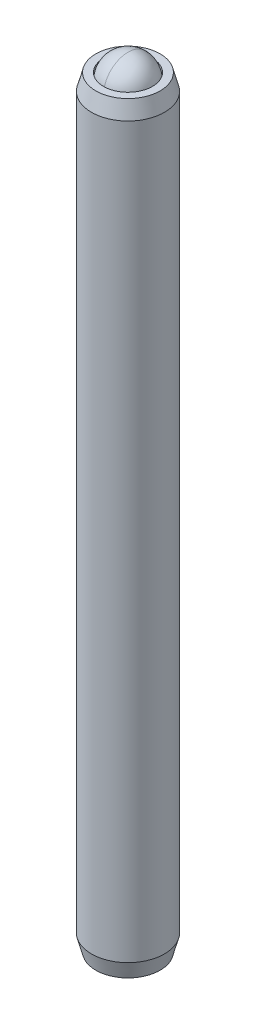
ISO-10303-21;
HEADER;
FILE_DESCRIPTION(('STEP AP214'),'2;1');
FILE_NAME('part.step','',(''),(''),'','','');
FILE_SCHEMA(('AUTOMOTIVE_DESIGN { 1 0 10303 214 1 1 1 1 }'));
ENDSEC;
DATA;
#1=APPLICATION_CONTEXT('core data for automotive mechanical design processes');
#2=APPLICATION_PROTOCOL_DEFINITION('international standard','automotive_design',2000,#1);
#3=PRODUCT_CONTEXT('',#1,'mechanical');
#4=PRODUCT('Part','Part','',(#3));
#5=PRODUCT_RELATED_PRODUCT_CATEGORY('part','',(#4));
#6=PRODUCT_DEFINITION_FORMATION('','',#4);
#7=PRODUCT_DEFINITION_CONTEXT('part definition',#1,'design');
#8=PRODUCT_DEFINITION('design','',#6,#7);
#9=PRODUCT_DEFINITION_SHAPE('','',#8);
#10=(LENGTH_UNIT() NAMED_UNIT(*) SI_UNIT(.MILLI.,.METRE.));
#11=(NAMED_UNIT(*) PLANE_ANGLE_UNIT() SI_UNIT($,.RADIAN.));
#12=(NAMED_UNIT(*) SI_UNIT($,.STERADIAN.) SOLID_ANGLE_UNIT());
#13=UNCERTAINTY_MEASURE_WITH_UNIT(LENGTH_MEASURE(1.E-05),#10,'distance_accuracy_value','');
#14=(GEOMETRIC_REPRESENTATION_CONTEXT(3) GLOBAL_UNCERTAINTY_ASSIGNED_CONTEXT((#13)) GLOBAL_UNIT_ASSIGNED_CONTEXT((#10,
#11,#12)) REPRESENTATION_CONTEXT('',''));
#15=CARTESIAN_POINT('',(0.,0.,0.));
#16=DIRECTION('',(0.,0.,1.));
#17=DIRECTION('',(1.,0.,0.));
#18=AXIS2_PLACEMENT_3D('',#15,#16,#17);
#19=CARTESIAN_POINT('',(19.4363284208888,41.2034664930245,44.0016091784488));
#20=DIRECTION('',(0.,0.,-1.));
#21=DIRECTION('',(1.,0.,0.));
#22=AXIS2_PLACEMENT_3D('',#19,#20,#21);
#23=SPHERICAL_SURFACE('',#22,1.5875);
#24=CARTESIAN_POINT('',(19.4363284208888,41.2034664930245,44.0016091784488));
#25=DIRECTION('',(0.,-1.,0.));
#26=DIRECTION('',(1.,0.,0.));
#27=AXIS2_PLACEMENT_3D('',#24,#25,#26);
#28=CIRCLE('',#27,1.5875);
#29=CARTESIAN_POINT('',(19.4363284208888,41.2034664930245,45.5891091784488));
#30=VERTEX_POINT('',#29);
#31=CARTESIAN_POINT('',(19.4363284208888,41.2034664930245,42.4141091784488));
#32=VERTEX_POINT('',#31);
#33=EDGE_CURVE('P0_E37',#30,#32,#28,.T.);
#34=ORIENTED_EDGE('',*,*,#33,.F.);
#35=CARTESIAN_POINT('',(19.4363284208888,41.2034664930245,44.0016091784488));
#36=DIRECTION('',(-1.,0.,0.));
#37=DIRECTION('',(0.,-1.,0.));
#38=AXIS2_PLACEMENT_3D('',#35,#36,#37);
#39=CIRCLE('',#38,1.5875);
#40=EDGE_CURVE('P0_E11',#30,#32,#39,.T.);
#41=ORIENTED_EDGE('',*,*,#40,.T.);
#42=EDGE_LOOP('',(#34,#41));
#43=FACE_BOUND('',#42,.T.);
#44=ADVANCED_FACE('P0_F16',(#43),#23,.T.);
#45=ORIENTED_EDGE('',*,*,#33,.T.);
#46=CARTESIAN_POINT('',(19.4363284208888,41.2034664930245,44.0016091784488));
#47=DIRECTION('',(-1.,0.,0.));
#48=DIRECTION('',(0.,-1.,0.));
#49=AXIS2_PLACEMENT_3D('',#46,#47,#48);
#50=CIRCLE('',#49,1.5875);
#51=EDGE_CURVE('P0_E23',#32,#30,#50,.T.);
#52=ORIENTED_EDGE('',*,*,#51,.T.);
#53=EDGE_LOOP('',(#45,#52));
#54=FACE_BOUND('',#53,.T.);
#55=ADVANCED_FACE('P0_F36',(#54),#23,.T.);
#56=ORIENTED_EDGE('',*,*,#51,.F.);
#57=EDGE_CURVE('P0_E33',#32,#30,#28,.T.);
#58=ORIENTED_EDGE('',*,*,#57,.T.);
#59=EDGE_LOOP('',(#56,#58));
#60=FACE_BOUND('',#59,.T.);
#61=ADVANCED_FACE('P0_F39',(#60),#23,.T.);
#62=ORIENTED_EDGE('',*,*,#40,.F.);
#63=ORIENTED_EDGE('',*,*,#57,.F.);
#64=EDGE_LOOP('',(#62,#63));
#65=FACE_BOUND('',#64,.T.);
#66=ADVANCED_FACE('P0_F18',(#65),#23,.T.);
#67=CLOSED_SHELL('',(#44,#55,#61,#66));
#68=MANIFOLD_SOLID_BREP('P0_B1',#67);
#69=CARTESIAN_POINT('',(19.4363284208888,-6.85968350697545,44.0016091784488));
#70=DIRECTION('',(0.,-1.,0.));
#71=DIRECTION('',(1.,0.,0.));
#72=AXIS2_PLACEMENT_3D('',#69,#70,#71);
#73=CONICAL_SURFACE('',#72,0.,0.785398163397452);
#74=CARTESIAN_POINT('',(19.4363284208888,-8.00268350697544,44.0016091784488));
#75=DIRECTION('',(0.,1.,0.));
#76=DIRECTION('',(-1.,0.,0.));
#77=AXIS2_PLACEMENT_3D('',#74,#75,#76);
#78=CIRCLE('',#77,1.143);
#79=CARTESIAN_POINT('',(20.5793189322147,-8.00268350697544,43.9969518166343));
#80=VERTEX_POINT('',#79);
#81=CARTESIAN_POINT('',(20.0118570701977,-8.00268350697544,43.0140790402633));
#82=VERTEX_POINT('',#81);
#83=EDGE_CURVE('P1_E241',#80,#82,#78,.T.);
#84=ORIENTED_EDGE('',*,*,#83,.F.);
#85=CARTESIAN_POINT('',(20.5795284208888,-8.00289157328465,43.9973146616615));
#86=CARTESIAN_POINT('',(20.5795257144675,-8.00288888449195,43.9973099740023));
#87=CARTESIAN_POINT('',(20.5795230080402,-8.00288619572221,43.9973052863328));
#88=CARTESIAN_POINT('',(20.5600306777428,-7.98352124668565,43.9635435799138));
#89=CARTESIAN_POINT('',(20.5402345814781,-7.96534984259609,43.9292557353815));
#90=CARTESIAN_POINT('',(20.4999732437292,-7.93214996165345,43.8595210528121));
#91=CARTESIAN_POINT('',(20.4795076352042,-7.91712324333893,43.8240735790419));
#92=CARTESIAN_POINT('',(20.4379766526946,-7.89117950454162,43.752139807249));
#93=CARTESIAN_POINT('',(20.4169129129655,-7.8802522639107,43.71565633984));
#94=CARTESIAN_POINT('',(20.3742945535118,-7.8634157329125,43.6418391759304));
#95=CARTESIAN_POINT('',(20.3527404730571,-7.85750117992885,43.6045064134727));
#96=CARTESIAN_POINT('',(20.3155662540117,-7.85219081735782,43.5401187773544));
#97=CARTESIAN_POINT('',(20.2999934074969,-7.85142371548408,43.5131458159723));
#98=CARTESIAN_POINT('',(20.2688792224096,-7.85281959215813,43.4592544665649));
#99=CARTESIAN_POINT('',(20.2533378913283,-7.85498320049636,43.4323360915149));
#100=CARTESIAN_POINT('',(20.2069289668936,-7.86572571714785,43.3519534764695));
#101=CARTESIAN_POINT('',(20.1762943247543,-7.87855868149786,43.2988927198124));
#102=CARTESIAN_POINT('',(20.1230854280154,-7.90918374679279,43.2067322072459));
#103=CARTESIAN_POINT('',(20.1002391952613,-7.92522787163296,43.1671613713544));
#104=CARTESIAN_POINT('',(20.0553560107262,-7.96131856801589,43.089421415334));
#105=CARTESIAN_POINT('',(20.0333191554072,-7.98136561480879,43.0512524622825));
#106=CARTESIAN_POINT('',(19.9902331277341,-8.0241621361576,42.9766252732564));
#107=CARTESIAN_POINT('',(19.969175697669,-8.04687908314869,42.9401527345068));
#108=CARTESIAN_POINT('',(19.9277513096075,-8.09440258828207,42.8684035897118));
#109=CARTESIAN_POINT('',(19.9073822280737,-8.11920169963308,42.8331233055918));
#110=CARTESIAN_POINT('',(19.8872656451284,-8.14473005128733,42.7982803618558));
#111=B_SPLINE_CURVE_WITH_KNOTS('',3,(#85,#86,#87,#88,#89,#90,#91,#92,#93,#94,#95,#96,#97,#98,
#99,#100,#101,#102,#103,#104,#105,#106,#107,#108,#109,#110),.UNSPECIFIED.,.F.,.F.,(4,2,2,2,2,2,
2,2,2,2,2,2,4),(0.,1.81316377766521E-05,0.130588066149644,0.261230822659524,0.391545682806067,
0.521723560618484,0.61505376898685,0.708404036588612,0.895210399439819,1.04029045701993,
1.18538774959988,1.32887166801466,1.47186265945496),.UNSPECIFIED.);
#112=EDGE_CURVE('P1_E11',#80,#82,#111,.T.);
#113=ORIENTED_EDGE('',*,*,#112,.T.);
#114=EDGE_LOOP('',(#84,#113));
#115=FACE_BOUND('',#114,.T.);
#116=ADVANCED_FACE('P1_F16',(#115),#73,.F.);
#117=CARTESIAN_POINT('',(20.0037902829058,-8.00268350697544,43.0094216784488));
#118=VERTEX_POINT('',#117);
#119=CARTESIAN_POINT('',(18.8688665588719,-8.00268350697544,43.0094216784488));
#120=VERTEX_POINT('',#119);
#121=EDGE_CURVE('P1_E245',#118,#120,#78,.T.);
#122=ORIENTED_EDGE('',*,*,#121,.F.);
#123=CARTESIAN_POINT('',(18.2956976132517,-8.37146215297065,43.0094216784488));
#124=CARTESIAN_POINT('',(18.3234795799085,-8.3505039669229,43.0094216784488));
#125=CARTESIAN_POINT('',(18.3514165472458,-8.32975182567534,43.0094216784488));
#126=CARTESIAN_POINT('',(18.4076632979894,-8.28874468856195,43.0094216784488));
#127=CARTESIAN_POINT('',(18.4359731727808,-8.26848981817666,43.0094216784488));
#128=CARTESIAN_POINT('',(18.5219708570497,-8.20830969756909,43.0094216784488));
#129=CARTESIAN_POINT('',(18.5803043030779,-8.16929175546804,43.0094216784488));
#130=CARTESIAN_POINT('',(18.7026153822138,-8.09271173297564,43.0094216784488));
#131=CARTESIAN_POINT('',(18.7667253455534,-8.05535859651509,43.0094216784488));
#132=CARTESIAN_POINT('',(18.8981450647406,-7.98704353196994,43.0094216784488));
#133=CARTESIAN_POINT('',(18.9654430549452,-7.95606006064756,43.0094216784488));
#134=CARTESIAN_POINT('',(19.0664756524543,-7.9181552165379,43.0094216784488));
#135=CARTESIAN_POINT('',(19.0987183686434,-7.90727317477064,43.0094216784488));
#136=CARTESIAN_POINT('',(19.1639805892829,-7.8880978757605,43.0094216784488));
#137=CARTESIAN_POINT('',(19.1970001472332,-7.87980479737932,43.0094216784488));
#138=CARTESIAN_POINT('',(19.2630626115991,-7.86637686449944,43.0094216784488));
#139=CARTESIAN_POINT('',(19.2960942744037,-7.8611875549149,43.0094216784488));
#140=CARTESIAN_POINT('',(19.3625196064881,-7.8540648590462,43.0094216784488));
#141=CARTESIAN_POINT('',(19.395913330646,-7.85213197348667,43.0094216784488));
#142=CARTESIAN_POINT('',(19.4615227040728,-7.85166805763632,43.0094216784488));
#143=CARTESIAN_POINT('',(19.4937375479298,-7.85301723119191,43.0094216784488));
#144=CARTESIAN_POINT('',(19.557879675408,-7.85877819024429,43.0094216784488));
#145=CARTESIAN_POINT('',(19.58980702331,-7.86318927299811,43.0094216784488));
#146=CARTESIAN_POINT('',(19.6536995168981,-7.87490835617852,43.0094216784488));
#147=CARTESIAN_POINT('',(19.6856554098724,-7.88226604695359,43.0094216784488));
#148=CARTESIAN_POINT('',(19.7488692017713,-7.89948781984245,43.0094216784488));
#149=CARTESIAN_POINT('',(19.7801271594913,-7.90935168995766,43.0094216784488));
#150=CARTESIAN_POINT('',(19.8786239753269,-7.94414206598179,43.0094216784488));
#151=CARTESIAN_POINT('',(19.9444586897626,-7.9730342916115,43.0094216784488));
#152=CARTESIAN_POINT('',(20.0730345784676,-8.03727019133514,43.0094216784488));
#153=CARTESIAN_POINT('',(20.1357635656807,-8.07263706068711,43.0094216784488));
#154=CARTESIAN_POINT('',(20.2556464363632,-8.1455993766631,43.0094216784488));
#155=CARTESIAN_POINT('',(20.3129224486739,-8.18299663783958,43.0094216784488));
#156=CARTESIAN_POINT('',(20.3973071662296,-8.2408078059348,43.0094216784488));
#157=CARTESIAN_POINT('',(20.425071165797,-8.2602818170261,43.0094216784488));
#158=CARTESIAN_POINT('',(20.4802198408537,-8.29974458995869,43.0094216784488));
#159=CARTESIAN_POINT('',(20.5076046179868,-8.31973320959427,43.0094216784488));
#160=CARTESIAN_POINT('',(20.5348315050751,-8.33993519541325,43.0094216784488));
#161=B_SPLINE_CURVE_WITH_KNOTS('',3,(#123,#124,#125,#126,#127,#128,#129,#130,#131,#132,#133,
#134,#135,#136,#137,#138,#139,#140,#141,#142,#143,#144,#145,#146,#147,#148,#149,#150,#151,#152,
#153,#154,#155,#156,#157,#158,#159,#160),.UNSPECIFIED.,.F.,.F.,(4,2,2,2,2,2,2,2,2,2,2,2,2,2,2,2,
2,2,4),(0.,0.104399205750145,0.208824490153929,0.419269037607603,0.641680044169895,
0.863325974887587,0.965328311414922,1.06733769333986,1.16750041530699,1.26767853740811,
1.3642553320756,1.46080996859686,1.55906646638462,1.6573146553866,1.87236816316004,
2.08820773237252,2.29331760239732,2.39505206150514,2.49675870307947),.UNSPECIFIED.);
#162=EDGE_CURVE('P1_E30',#118,#120,#161,.F.);
#163=ORIENTED_EDGE('',*,*,#162,.T.);
#164=EDGE_LOOP('',(#122,#163));
#165=FACE_BOUND('',#164,.T.);
#166=ADVANCED_FACE('P1_F232',(#165),#73,.F.);
#167=CARTESIAN_POINT('',(18.8607997715799,-8.00268350697544,43.0140790402633));
#168=VERTEX_POINT('',#167);
#169=CARTESIAN_POINT('',(18.293337909563,-8.00268350697544,43.9969518166343));
#170=VERTEX_POINT('',#169);
#171=EDGE_CURVE('P1_E162',#168,#170,#78,.T.);
#172=ORIENTED_EDGE('',*,*,#171,.F.);
#173=CARTESIAN_POINT('',(18.9853911966492,-8.14473005128732,42.7982803618558));
#174=CARTESIAN_POINT('',(18.9654134434931,-8.11937636137871,42.8328828453433));
#175=CARTESIAN_POINT('',(18.9451843015619,-8.09474115364876,42.8679207469617));
#176=CARTESIAN_POINT('',(18.9037667580097,-8.04718761012867,42.9396580367188));
#177=CARTESIAN_POINT('',(18.8825678396076,-8.02430611311324,42.9763756404567));
#178=CARTESIAN_POINT('',(18.8414277221805,-7.98344086308087,43.0476324140698));
#179=CARTESIAN_POINT('',(18.8215513649233,-7.9651998992218,43.0820592747088));
#180=CARTESIAN_POINT('',(18.7811279003515,-7.93189582831574,43.152074769165));
#181=CARTESIAN_POINT('',(18.7605806659785,-7.91683332732174,43.1876636230541));
#182=CARTESIAN_POINT('',(18.719043948857,-7.89095675040179,43.2596073274882));
#183=CARTESIAN_POINT('',(18.6980611170448,-7.88010089726359,43.2959506582735));
#184=CARTESIAN_POINT('',(18.6556073575053,-7.86336944280465,43.3694827267684));
#185=CARTESIAN_POINT('',(18.6341369163087,-7.85748908339188,43.4066706217818));
#186=CARTESIAN_POINT('',(18.5970580612995,-7.85219241325834,43.4708930825442));
#187=CARTESIAN_POINT('',(18.5814962532154,-7.85142478466415,43.4978469248033));
#188=CARTESIAN_POINT('',(18.5504040008211,-7.85281556334071,43.5517002856722));
#189=CARTESIAN_POINT('',(18.534873563838,-7.85497458932804,43.5785997915906));
#190=CARTESIAN_POINT('',(18.4884533156515,-7.86570756358604,43.6590020199496));
#191=CARTESIAN_POINT('',(18.4577970613585,-7.87854568745243,43.7121002099549));
#192=CARTESIAN_POINT('',(18.404579967435,-7.90917616466416,43.8042749204615));
#193=CARTESIAN_POINT('',(18.3817461733049,-7.92521041550376,43.8438242120244));
#194=CARTESIAN_POINT('',(18.3480907334006,-7.95226751774215,43.9021171438896));
#195=CARTESIAN_POINT('',(18.3369627717022,-7.96179636268222,43.921391338936));
#196=CARTESIAN_POINT('',(18.3149047512131,-7.98172113786374,43.9595969511375));
#197=CARTESIAN_POINT('',(18.303974667269,-7.99211695694335,43.9785284118597));
#198=CARTESIAN_POINT('',(18.2698963109932,-8.02597025323001,44.0375538563679));
#199=CARTESIAN_POINT('',(18.2470789026698,-8.0507616336181,44.0770747668809));
#200=CARTESIAN_POINT('',(18.2021515675663,-8.10280357376023,44.1548911939288));
#201=CARTESIAN_POINT('',(18.1800420682185,-8.13005558266673,44.1931859701291));
#202=CARTESIAN_POINT('',(18.136341539269,-8.18643901453588,44.2688775065874));
#203=CARTESIAN_POINT('',(18.1147522320756,-8.21557574597252,44.3062712835465));
#204=CARTESIAN_POINT('',(18.0720452176147,-8.2752047403616,44.3802420024324));
#205=CARTESIAN_POINT('',(18.0509275843405,-8.30569721378192,44.4168188161989));
#206=CARTESIAN_POINT('',(17.9894173425083,-8.39681603650873,44.5233576802382));
#207=CARTESIAN_POINT('',(17.9495468767431,-8.45885026609265,44.5924153526649));
#208=CARTESIAN_POINT('',(17.8906097620809,-8.55343956980017,44.6944974297114));
#209=CARTESIAN_POINT('',(17.8711795217175,-8.58510502947861,44.7281515932241));
#210=CARTESIAN_POINT('',(17.8325232709737,-8.64891553809655,44.7951061835424));
#211=CARTESIAN_POINT('',(17.8132972206542,-8.68106049017623,44.8284066795247));
#212=CARTESIAN_POINT('',(17.7941526793724,-8.71340055577849,44.8615659977124));
#213=B_SPLINE_CURVE_WITH_KNOTS('',3,(#173,#174,#175,#176,#177,#178,#179,#180,#181,#182,#183,
#184,#185,#186,#187,#188,#189,#190,#191,#192,#193,#194,#195,#196,#197,#198,#199,#200,#201,#202,
#203,#204,#205,#206,#207,#208,#209,#210,#211,#212),.UNSPECIFIED.,.F.,.F.,(4,2,2,2,2,2,2,2,2,2,2,
2,2,2,2,2,2,2,2,4),(0.,0.142015492124806,0.28647478580433,0.417582578490755,0.548715347595062,
0.678510217108288,0.808180822332932,0.901445197909871,0.994729293345598,1.18166731759613,
1.32665810540213,1.39927013153267,1.47187286175304,1.62755511883546,1.78332966839059,
1.93956387642132,2.09582242380834,2.39881912123291,2.54920251539603,2.69955593206455),.UNSPECIFIED.);
#214=EDGE_CURVE('P1_E258',#168,#170,#213,.T.);
#215=ORIENTED_EDGE('',*,*,#214,.T.);
#216=EDGE_LOOP('',(#172,#215));
#217=FACE_BOUND('',#216,.T.);
#218=ADVANCED_FACE('P1_F237',(#217),#73,.F.);
#219=CARTESIAN_POINT('',(18.293337909563,-8.00268350697544,44.0062665402633));
#220=VERTEX_POINT('',#219);
#221=CARTESIAN_POINT('',(18.8607997715799,-8.00268350697544,44.9891393166343));
#222=VERTEX_POINT('',#221);
#223=EDGE_CURVE('P1_E173',#220,#222,#78,.T.);
#224=ORIENTED_EDGE('',*,*,#223,.F.);
#225=CARTESIAN_POINT('',(18.2931284208888,-8.00289157328465,44.0059036952361));
#226=CARTESIAN_POINT('',(18.2931311273102,-8.00288888449195,44.0059083828953));
#227=CARTESIAN_POINT('',(18.2931338337374,-8.00288619572221,44.0059130705648));
#228=CARTESIAN_POINT('',(18.3126261640282,-7.98352124668405,44.0396747769866));
#229=CARTESIAN_POINT('',(18.3324222602976,-7.96534984259576,44.0739626215167));
#230=CARTESIAN_POINT('',(18.37268359805,-7.93214996165405,44.1436973040843));
#231=CARTESIAN_POINT('',(18.3931492065737,-7.91712324333921,44.1791447778551));
#232=CARTESIAN_POINT('',(18.4346801890824,-7.89117950454161,44.2510785496485));
#233=CARTESIAN_POINT('',(18.4557439288119,-7.88025226391073,44.2875620170575));
#234=CARTESIAN_POINT('',(18.4983622882659,-7.86341573291254,44.361379180967));
#235=CARTESIAN_POINT('',(18.5199163687205,-7.85750117992886,44.3987119434249));
#236=CARTESIAN_POINT('',(18.557090587766,-7.85219081735781,44.4630995795433));
#237=CARTESIAN_POINT('',(18.5726634342808,-7.85142371548408,44.4900725409254));
#238=CARTESIAN_POINT('',(18.6037776193682,-7.85281959215814,44.5439638903328));
#239=CARTESIAN_POINT('',(18.6193189504495,-7.85498320049638,44.5708822653829));
#240=CARTESIAN_POINT('',(18.6657278748841,-7.86572571714789,44.6512648804283));
#241=CARTESIAN_POINT('',(18.6963625170234,-7.87855868149789,44.7043256370853));
#242=CARTESIAN_POINT('',(18.7495714137623,-7.90918374679278,44.7964861496517));
#243=CARTESIAN_POINT('',(18.7724176465163,-7.92522787163294,44.8360569855432));
#244=CARTESIAN_POINT('',(18.8173008310515,-7.96131856801587,44.9137969415636));
#245=CARTESIAN_POINT('',(18.8393376863704,-7.98136561480878,44.9519658946151));
#246=CARTESIAN_POINT('',(18.8824237140435,-8.02416213615762,45.0265930836412));
#247=CARTESIAN_POINT('',(18.9034811441087,-8.04687908314873,45.0630656223908));
#248=CARTESIAN_POINT('',(18.9449055321702,-8.0944025882821,45.1348147671858));
#249=CARTESIAN_POINT('',(18.9652746137039,-8.11920169963309,45.1700950513058));
#250=CARTESIAN_POINT('',(18.9853911966492,-8.14473005128733,45.2049379950418));
#251=B_SPLINE_CURVE_WITH_KNOTS('',3,(#225,#226,#227,#228,#229,#230,#231,#232,#233,#234,#235,
#236,#237,#238,#239,#240,#241,#242,#243,#244,#245,#246,#247,#248,#249,#250),.UNSPECIFIED.,.F.,
.F.,(4,2,2,2,2,2,2,2,2,2,2,2,4),(0.,1.81316377750985E-05,0.130588066149251,0.261230822658986,
0.391545682805917,0.521723560618475,0.615053768986976,0.708404036588908,0.895210399439817,
1.04029045701984,1.18538774959988,1.32887166801475,1.47186265945496),.UNSPECIFIED.);
#252=EDGE_CURVE('P1_E260',#220,#222,#251,.T.);
#253=ORIENTED_EDGE('',*,*,#252,.T.);
#254=EDGE_LOOP('',(#224,#253));
#255=FACE_BOUND('',#254,.T.);
#256=ADVANCED_FACE('P1_F297',(#255),#73,.F.);
#257=CARTESIAN_POINT('',(18.8688665588719,-8.00268350697544,44.9937966784488));
#258=VERTEX_POINT('',#257);
#259=CARTESIAN_POINT('',(20.0037902829058,-8.00268350697544,44.9937966784488));
#260=VERTEX_POINT('',#259);
#261=EDGE_CURVE('P1_E177',#258,#260,#78,.T.);
#262=ORIENTED_EDGE('',*,*,#261,.F.);
#263=CARTESIAN_POINT('',(18.2956976132517,-8.37146215297065,44.9937966784488));
#264=CARTESIAN_POINT('',(18.3234795799085,-8.3505039669229,44.9937966784488));
#265=CARTESIAN_POINT('',(18.3514165472458,-8.32975182567534,44.9937966784488));
#266=CARTESIAN_POINT('',(18.4076632979894,-8.28874468856195,44.9937966784488));
#267=CARTESIAN_POINT('',(18.4359731727808,-8.26848981817666,44.9937966784488));
#268=CARTESIAN_POINT('',(18.5219708570497,-8.20830969756909,44.9937966784488));
#269=CARTESIAN_POINT('',(18.5803043030779,-8.16929175546804,44.9937966784488));
#270=CARTESIAN_POINT('',(18.7026153822138,-8.09271173297564,44.9937966784488));
#271=CARTESIAN_POINT('',(18.7667253455534,-8.05535859651509,44.9937966784488));
#272=CARTESIAN_POINT('',(18.8981450647406,-7.98704353196994,44.9937966784488));
#273=CARTESIAN_POINT('',(18.9654430549452,-7.95606006064756,44.9937966784488));
#274=CARTESIAN_POINT('',(19.0664756524543,-7.9181552165379,44.9937966784488));
#275=CARTESIAN_POINT('',(19.0987183686434,-7.90727317477064,44.9937966784488));
#276=CARTESIAN_POINT('',(19.1639805892829,-7.8880978757605,44.9937966784488));
#277=CARTESIAN_POINT('',(19.1970001472332,-7.87980479737932,44.9937966784488));
#278=CARTESIAN_POINT('',(19.2630626115991,-7.86637686449944,44.9937966784488));
#279=CARTESIAN_POINT('',(19.2960942744037,-7.8611875549149,44.9937966784488));
#280=CARTESIAN_POINT('',(19.3625196064881,-7.8540648590462,44.9937966784488));
#281=CARTESIAN_POINT('',(19.395913330646,-7.85213197348667,44.9937966784488));
#282=CARTESIAN_POINT('',(19.4615227040728,-7.85166805763632,44.9937966784488));
#283=CARTESIAN_POINT('',(19.4937375479298,-7.85301723119191,44.9937966784488));
#284=CARTESIAN_POINT('',(19.557879675408,-7.85877819024429,44.9937966784488));
#285=CARTESIAN_POINT('',(19.58980702331,-7.86318927299811,44.9937966784488));
#286=CARTESIAN_POINT('',(19.6536995168981,-7.87490835617852,44.9937966784488));
#287=CARTESIAN_POINT('',(19.6856554098724,-7.88226604695359,44.9937966784488));
#288=CARTESIAN_POINT('',(19.7488692017713,-7.89948781984245,44.9937966784488));
#289=CARTESIAN_POINT('',(19.7801271594913,-7.90935168995766,44.9937966784488));
#290=CARTESIAN_POINT('',(19.8786239753269,-7.94414206598179,44.9937966784488));
#291=CARTESIAN_POINT('',(19.9444586897626,-7.9730342916115,44.9937966784488));
#292=CARTESIAN_POINT('',(20.0730345784676,-8.03727019133514,44.9937966784488));
#293=CARTESIAN_POINT('',(20.1357635656807,-8.07263706068711,44.9937966784488));
#294=CARTESIAN_POINT('',(20.2556464363632,-8.1455993766631,44.9937966784488));
#295=CARTESIAN_POINT('',(20.3129224486739,-8.18299663783958,44.9937966784488));
#296=CARTESIAN_POINT('',(20.3973071662296,-8.2408078059348,44.9937966784488));
#297=CARTESIAN_POINT('',(20.425071165797,-8.26028181702611,44.9937966784488));
#298=CARTESIAN_POINT('',(20.4802198408537,-8.29974458995869,44.9937966784488));
#299=CARTESIAN_POINT('',(20.5076046179868,-8.31973320959427,44.9937966784488));
#300=CARTESIAN_POINT('',(20.5348315050751,-8.33993519541325,44.9937966784488));
#301=B_SPLINE_CURVE_WITH_KNOTS('',3,(#263,#264,#265,#266,#267,#268,#269,#270,#271,#272,#273,
#274,#275,#276,#277,#278,#279,#280,#281,#282,#283,#284,#285,#286,#287,#288,#289,#290,#291,#292,
#293,#294,#295,#296,#297,#298,#299,#300),.UNSPECIFIED.,.F.,.F.,(4,2,2,2,2,2,2,2,2,2,2,2,2,2,2,2,
2,2,4),(0.,0.104399205750145,0.208824490153929,0.419269037607603,0.641680044169895,
0.863325974887587,0.965328311414922,1.06733769333986,1.16750041530699,1.26767853740811,
1.3642553320756,1.46080996859686,1.55906646638462,1.6573146553866,1.87236816316004,
2.08820773237252,2.29331760239732,2.39505206150514,2.49675870307947),.UNSPECIFIED.);
#302=EDGE_CURVE('P1_E202',#258,#260,#301,.T.);
#303=ORIENTED_EDGE('',*,*,#302,.T.);
#304=EDGE_LOOP('',(#262,#303));
#305=FACE_BOUND('',#304,.T.);
#306=ADVANCED_FACE('P1_F230',(#305),#73,.F.);
#307=CARTESIAN_POINT('',(19.4363284208888,40.5522524627573,44.0016091784488));
#308=DIRECTION('',(0.,1.,0.));
#309=DIRECTION('',(-1.,0.,0.));
#310=AXIS2_PLACEMENT_3D('',#307,#308,#309);
#311=CONICAL_SURFACE('',#310,1.59385,0.785398163397443);
#312=CARTESIAN_POINT('',(19.4363284208888,38.9584024627573,44.0016091784488));
#313=VERTEX_POINT('',#312);
#314=VERTEX_LOOP('',#313);
#315=FACE_BOUND('',#314,.T.);
#316=CARTESIAN_POINT('',(19.4363284208888,40.5522524627573,44.0016091784488));
#317=DIRECTION('',(0.,1.,0.));
#318=DIRECTION('',(-1.,0.,0.));
#319=AXIS2_PLACEMENT_3D('',#316,#317,#318);
#320=CIRCLE('',#319,1.59385);
#321=CARTESIAN_POINT('',(17.8424784208888,40.5522524627573,44.0016091784488));
#322=VERTEX_POINT('',#321);
#323=EDGE_CURVE('P1_E192',#322,#322,#320,.T.);
#324=ORIENTED_EDGE('',*,*,#323,.T.);
#325=EDGE_LOOP('',(#324));
#326=FACE_BOUND('',#325,.T.);
#327=ADVANCED_FACE('P1_F18',(#315,#326),#311,.F.);
#328=CARTESIAN_POINT('',(19.4363284208888,38.9584024627573,44.0016091784488));
#329=DIRECTION('',(0.,1.,0.));
#330=DIRECTION('',(-1.,0.,0.));
#331=AXIS2_PLACEMENT_3D('',#328,#329,#330);
#332=CYLINDRICAL_SURFACE('',#331,1.59385);
#333=ORIENTED_EDGE('',*,*,#323,.F.);
#334=EDGE_LOOP('',(#333));
#335=FACE_BOUND('',#334,.T.);
#336=CARTESIAN_POINT('',(19.4363284208888,41.6543164930246,44.0016091784488));
#337=DIRECTION('',(0.,1.,0.));
#338=DIRECTION('',(-1.,0.,0.));
#339=AXIS2_PLACEMENT_3D('',#336,#337,#338);
#340=CIRCLE('',#339,1.59385);
#341=CARTESIAN_POINT('',(17.8424784208888,41.6543164930246,44.0016091784488));
#342=VERTEX_POINT('',#341);
#343=EDGE_CURVE('P1_E189',#342,#342,#340,.T.);
#344=ORIENTED_EDGE('',*,*,#343,.T.);
#345=EDGE_LOOP('',(#344));
#346=FACE_BOUND('',#345,.T.);
#347=ADVANCED_FACE('P1_F342',(#335,#346),#332,.F.);
#348=CARTESIAN_POINT('',(21.0301784208888,41.6543164930246,44.0016091784488));
#349=DIRECTION('',(0.,-1.,0.));
#350=DIRECTION('',(1.,0.,0.));
#351=AXIS2_PLACEMENT_3D('',#348,#349,#350);
#352=PLANE('',#351);
#353=ORIENTED_EDGE('',*,*,#343,.F.);
#354=EDGE_LOOP('',(#353));
#355=FACE_BOUND('',#354,.T.);
#356=CARTESIAN_POINT('',(19.4363284208888,41.6543164930246,44.0016091784488));
#357=DIRECTION('',(0.,1.,0.));
#358=DIRECTION('',(-1.,0.,0.));
#359=AXIS2_PLACEMENT_3D('',#356,#357,#358);
#360=CIRCLE('',#359,2.0955);
#361=CARTESIAN_POINT('',(17.3408284208888,41.6543164930246,44.0016091784488));
#362=VERTEX_POINT('',#361);
#363=EDGE_CURVE('P1_E186',#362,#362,#360,.T.);
#364=ORIENTED_EDGE('',*,*,#363,.T.);
#365=EDGE_LOOP('',(#364));
#366=FACE_BOUND('',#365,.T.);
#367=ADVANCED_FACE('P1_F349',(#355,#366),#352,.F.);
#368=CARTESIAN_POINT('',(19.4363284208888,40.5878829747618,44.0016091784488));
#369=DIRECTION('',(0.,-1.,0.));
#370=DIRECTION('',(1.,0.,0.));
#371=AXIS2_PLACEMENT_3D('',#368,#369,#370);
#372=CONICAL_SURFACE('',#371,2.38125,0.261799387799151);
#373=ORIENTED_EDGE('',*,*,#363,.F.);
#374=EDGE_LOOP('',(#373));
#375=FACE_BOUND('',#374,.T.);
#376=CARTESIAN_POINT('',(19.4363284208888,40.5878829747618,44.0016091784488));
#377=DIRECTION('',(0.,1.,0.));
#378=DIRECTION('',(-1.,0.,0.));
#379=AXIS2_PLACEMENT_3D('',#376,#377,#378);
#380=CIRCLE('',#379,2.38125);
#381=CARTESIAN_POINT('',(17.0550784208888,40.5878829747618,44.0016091784488));
#382=VERTEX_POINT('',#381);
#383=EDGE_CURVE('P1_E183',#382,#382,#380,.T.);
#384=ORIENTED_EDGE('',*,*,#383,.T.);
#385=EDGE_LOOP('',(#384));
#386=FACE_BOUND('',#385,.T.);
#387=ADVANCED_FACE('P1_F357',(#375,#386),#372,.T.);
#388=CARTESIAN_POINT('',(19.4363284208888,38.9584024627573,44.0016091784488));
#389=DIRECTION('',(0.,1.,0.));
#390=DIRECTION('',(-1.,0.,0.));
#391=AXIS2_PLACEMENT_3D('',#388,#389,#390);
#392=CYLINDRICAL_SURFACE('',#391,2.38125);
#393=ORIENTED_EDGE('',*,*,#383,.F.);
#394=EDGE_LOOP('',(#393));
#395=FACE_BOUND('',#394,.T.);
#396=CARTESIAN_POINT('',(19.4363284208888,-6.93624998871263,44.0016091784488));
#397=DIRECTION('',(0.,1.,0.));
#398=DIRECTION('',(-1.,0.,0.));
#399=AXIS2_PLACEMENT_3D('',#396,#397,#398);
#400=CIRCLE('',#399,2.38125);
#401=CARTESIAN_POINT('',(17.0550784208888,-6.93624998871263,44.0016091784488));
#402=VERTEX_POINT('',#401);
#403=EDGE_CURVE('P1_E180',#402,#402,#400,.T.);
#404=ORIENTED_EDGE('',*,*,#403,.T.);
#405=EDGE_LOOP('',(#404));
#406=FACE_BOUND('',#405,.T.);
#407=ADVANCED_FACE('P1_F366',(#395,#406),#392,.T.);
#408=CARTESIAN_POINT('',(19.4363284208888,-8.00268350697544,44.0016091784488));
#409=DIRECTION('',(0.,1.,0.));
#410=DIRECTION('',(-1.,0.,0.));
#411=AXIS2_PLACEMENT_3D('',#408,#409,#410);
#412=CONICAL_SURFACE('',#411,2.0955,0.26179938779915);
#413=ORIENTED_EDGE('',*,*,#403,.F.);
#414=EDGE_LOOP('',(#413));
#415=FACE_BOUND('',#414,.T.);
#416=CARTESIAN_POINT('',(19.4363284208888,-8.00268350697544,44.0016091784488));
#417=DIRECTION('',(0.,1.,0.));
#418=DIRECTION('',(-1.,0.,0.));
#419=AXIS2_PLACEMENT_3D('',#416,#417,#418);
#420=CIRCLE('',#419,2.0955);
#421=CARTESIAN_POINT('',(17.3408284208888,-8.00268350697544,44.0016091784488));
#422=VERTEX_POINT('',#421);
#423=EDGE_CURVE('P1_E176',#422,#422,#420,.T.);
#424=ORIENTED_EDGE('',*,*,#423,.T.);
#425=EDGE_LOOP('',(#424));
#426=FACE_BOUND('',#425,.T.);
#427=ADVANCED_FACE('P1_F375',(#415,#426),#412,.T.);
#428=CARTESIAN_POINT('',(21.5318284208888,-8.00268350697544,44.0016091784488));
#429=DIRECTION('',(0.,1.,0.));
#430=DIRECTION('',(-1.,0.,0.));
#431=AXIS2_PLACEMENT_3D('',#428,#429,#430);
#432=PLANE('',#431);
#433=ORIENTED_EDGE('',*,*,#423,.F.);
#434=EDGE_LOOP('',(#433));
#435=FACE_BOUND('',#434,.T.);
#436=ORIENTED_EDGE('',*,*,#83,.T.);
#437=DIRECTION('',(0.5,0.,0.866025403784439));
#438=VECTOR('',#437,1.);
#439=CARTESIAN_POINT('',(20.0091681411004,-8.00268350697544,43.0094216784488));
#440=LINE('',#439,#438);
#441=CARTESIAN_POINT('',(20.0091681411004,-8.00268350697544,43.0094216784488));
#442=VERTEX_POINT('',#441);
#443=EDGE_CURVE('P1_E147',#442,#82,#440,.T.);
#444=ORIENTED_EDGE('',*,*,#443,.F.);
#445=DIRECTION('',(1.,0.,0.));
#446=VECTOR('',#445,1.);
#447=CARTESIAN_POINT('',(18.8634887006772,-8.00268350697544,43.0094216784488));
#448=LINE('',#447,#446);
#449=EDGE_CURVE('P1_E137',#118,#442,#448,.T.);
#450=ORIENTED_EDGE('',*,*,#449,.F.);
#451=ORIENTED_EDGE('',*,*,#121,.T.);
#452=CARTESIAN_POINT('',(18.8634887006772,-8.00268350697544,43.0094216784488));
#453=VERTEX_POINT('',#452);
#454=EDGE_CURVE('P1_E135',#453,#120,#448,.T.);
#455=ORIENTED_EDGE('',*,*,#454,.F.);
#456=DIRECTION('',(0.5,0.,-0.866025403784439));
#457=VECTOR('',#456,1.);
#458=CARTESIAN_POINT('',(18.2906489804657,-8.00268350697544,44.0016091784488));
#459=LINE('',#458,#457);
#460=EDGE_CURVE('P1_E157',#168,#453,#459,.T.);
#461=ORIENTED_EDGE('',*,*,#460,.F.);
#462=ORIENTED_EDGE('',*,*,#171,.T.);
#463=CARTESIAN_POINT('',(18.2906489804657,-8.00268350697544,44.0016091784488));
#464=VERTEX_POINT('',#463);
#465=EDGE_CURVE('P1_E158',#464,#170,#459,.T.);
#466=ORIENTED_EDGE('',*,*,#465,.F.);
#467=DIRECTION('',(-0.5,0.,-0.866025403784439));
#468=VECTOR('',#467,1.);
#469=CARTESIAN_POINT('',(18.8634887006772,-8.00268350697544,44.9937966784488));
#470=LINE('',#469,#468);
#471=EDGE_CURVE('P1_E154',#220,#464,#470,.T.);
#472=ORIENTED_EDGE('',*,*,#471,.F.);
#473=ORIENTED_EDGE('',*,*,#223,.T.);
#474=CARTESIAN_POINT('',(18.8634887006772,-8.00268350697544,44.9937966784488));
#475=VERTEX_POINT('',#474);
#476=EDGE_CURVE('P1_E155',#475,#222,#470,.T.);
#477=ORIENTED_EDGE('',*,*,#476,.F.);
#478=DIRECTION('',(-1.,0.,0.));
#479=VECTOR('',#478,1.);
#480=CARTESIAN_POINT('',(20.0091681411004,-8.00268350697544,44.9937966784488));
#481=LINE('',#480,#479);
#482=EDGE_CURVE('P1_E151',#258,#475,#481,.T.);
#483=ORIENTED_EDGE('',*,*,#482,.F.);
#484=ORIENTED_EDGE('',*,*,#261,.T.);
#485=CARTESIAN_POINT('',(20.0091681411004,-8.00268350697544,44.9937966784488));
#486=VERTEX_POINT('',#485);
#487=EDGE_CURVE('P1_E152',#486,#260,#481,.T.);
#488=ORIENTED_EDGE('',*,*,#487,.F.);
#489=DIRECTION('',(-0.5,0.,0.866025403784438));
#490=VECTOR('',#489,1.);
#491=CARTESIAN_POINT('',(20.582007861312,-8.00268350697544,44.0016091784488));
#492=LINE('',#491,#490);
#493=CARTESIAN_POINT('',(20.0118570701977,-8.00268350697544,44.9891393166343));
#494=VERTEX_POINT('',#493);
#495=EDGE_CURVE('P1_E149',#494,#486,#492,.T.);
#496=ORIENTED_EDGE('',*,*,#495,.F.);
#497=CARTESIAN_POINT('',(20.5793189322147,-8.00268350697544,44.0062665402633));
#498=VERTEX_POINT('',#497);
#499=EDGE_CURVE('P1_E244',#494,#498,#78,.T.);
#500=ORIENTED_EDGE('',*,*,#499,.T.);
#501=CARTESIAN_POINT('',(20.582007861312,-8.00268350697544,44.0016091784488));
#502=VERTEX_POINT('',#501);
#503=EDGE_CURVE('P1_E37',#502,#498,#492,.T.);
#504=ORIENTED_EDGE('',*,*,#503,.F.);
#505=EDGE_CURVE('P1_E119',#80,#502,#440,.T.);
#506=ORIENTED_EDGE('',*,*,#505,.F.);
#507=EDGE_LOOP('',(#436,#444,#450,#451,#455,#461,#462,#466,#472,#473,#477,#483,#484,#488,#496,
#500,#504,#506));
#508=FACE_BOUND('',#507,.T.);
#509=ADVANCED_FACE('P1_F228',(#435,#508),#432,.F.);
#510=ORIENTED_EDGE('',*,*,#499,.F.);
#511=CARTESIAN_POINT('',(19.8872656451284,-8.14473005128733,45.2049379950418));
#512=CARTESIAN_POINT('',(19.9072433982845,-8.11937636137871,45.1703355115543));
#513=CARTESIAN_POINT('',(19.9274725402157,-8.09474115364876,45.1352976099359));
#514=CARTESIAN_POINT('',(19.9688900837679,-8.04718761012867,45.0635603201788));
#515=CARTESIAN_POINT('',(19.99008900217,-8.02430611311324,45.0268427164409));
#516=CARTESIAN_POINT('',(20.0312291195971,-7.98344086308087,44.9555859428278));
#517=CARTESIAN_POINT('',(20.0511054768544,-7.9651998992218,44.9211590821889));
#518=CARTESIAN_POINT('',(20.0915289414261,-7.93189582831573,44.8511435877326));
#519=CARTESIAN_POINT('',(20.1120761757991,-7.91683332732173,44.8155547338436));
#520=CARTESIAN_POINT('',(20.1536128929207,-7.89095675040179,44.7436110294094));
#521=CARTESIAN_POINT('',(20.1745957247328,-7.88010089726359,44.7072676986241));
#522=CARTESIAN_POINT('',(20.2170494842724,-7.86336944280465,44.6337356301293));
#523=CARTESIAN_POINT('',(20.238519925469,-7.85748908339188,44.5965477351158));
#524=CARTESIAN_POINT('',(20.2755987804782,-7.85219241325833,44.5323252743534));
#525=CARTESIAN_POINT('',(20.2911605885622,-7.85142478466414,44.5053714320943));
#526=CARTESIAN_POINT('',(20.3222528409566,-7.85281556334071,44.4515180712254));
#527=CARTESIAN_POINT('',(20.3377832779397,-7.85497458932803,44.424618565307));
#528=CARTESIAN_POINT('',(20.3842035261262,-7.86570756358603,44.3442163369481));
#529=CARTESIAN_POINT('',(20.4148597804192,-7.87854568745243,44.2911181469428));
#530=CARTESIAN_POINT('',(20.4680768743427,-7.90917616466416,44.1989434364361));
#531=CARTESIAN_POINT('',(20.4909106684728,-7.92521041550376,44.1593941448732));
#532=CARTESIAN_POINT('',(20.524566108377,-7.95226751774215,44.101101213008));
#533=CARTESIAN_POINT('',(20.5356940700755,-7.96179636268222,44.0818270179616));
#534=CARTESIAN_POINT('',(20.5577520905646,-7.98172113786374,44.0436214057601));
#535=CARTESIAN_POINT('',(20.5686821745087,-7.99211695694334,44.0246899450379));
#536=CARTESIAN_POINT('',(20.6027605307845,-8.02597025323,43.9656645005297));
#537=CARTESIAN_POINT('',(20.6255779391078,-8.05076163361809,43.9261435900167));
#538=CARTESIAN_POINT('',(20.6705052742113,-8.10280357376023,43.8483271629688));
#539=CARTESIAN_POINT('',(20.6926147735591,-8.13005558266673,43.8100323867685));
#540=CARTESIAN_POINT('',(20.7363153025087,-8.18643901453588,43.7343408503102));
#541=CARTESIAN_POINT('',(20.757904609702,-8.21557574597252,43.6969470733511));
#542=CARTESIAN_POINT('',(20.800611624163,-8.27520474036159,43.6229763544652));
#543=CARTESIAN_POINT('',(20.8217292574371,-8.30569721378191,43.5863995406987));
#544=CARTESIAN_POINT('',(20.8832394992694,-8.39681603650872,43.4798606766594));
#545=CARTESIAN_POINT('',(20.9231099650346,-8.45885026609265,43.4108030042327));
#546=CARTESIAN_POINT('',(20.9820470796968,-8.55343956980017,43.3087209271862));
#547=CARTESIAN_POINT('',(21.0014773200602,-8.58510502947861,43.2750667636735));
#548=CARTESIAN_POINT('',(21.040133570804,-8.64891553809655,43.2081121733552));
#549=CARTESIAN_POINT('',(21.0593596211235,-8.68106049017623,43.1748116773729));
#550=CARTESIAN_POINT('',(21.0785041624053,-8.71340055577849,43.1416523591852));
#551=B_SPLINE_CURVE_WITH_KNOTS('',3,(#511,#512,#513,#514,#515,#516,#517,#518,#519,#520,#521,
#522,#523,#524,#525,#526,#527,#528,#529,#530,#531,#532,#533,#534,#535,#536,#537,#538,#539,#540,
#541,#542,#543,#544,#545,#546,#547,#548,#549,#550),.UNSPECIFIED.,.F.,.F.,(4,2,2,2,2,2,2,2,2,2,2,
2,2,2,2,2,2,2,2,4),(0.,0.142015492124811,0.286474785804335,0.417582578490761,0.548715347595068,
0.678510217108296,0.808180822332938,0.901445197909877,0.994729293345597,1.18166731759614,
1.32665810540214,1.39927013153267,1.47187286175305,1.62755511883546,1.7833296683906,
1.93956387642132,2.09582242380834,2.39881912123292,2.54920251539604,2.69955593206456),.UNSPECIFIED.);
#552=EDGE_CURVE('P1_E195',#494,#498,#551,.T.);
#553=ORIENTED_EDGE('',*,*,#552,.T.);
#554=EDGE_LOOP('',(#510,#553));
#555=FACE_BOUND('',#554,.T.);
#556=ADVANCED_FACE('P1_F209',(#555),#73,.F.);
#557=CARTESIAN_POINT('',(20.0091681411004,-4.95468350697544,43.0094216784488));
#558=DIRECTION('',(0.866025403784439,0.,-0.5));
#559=DIRECTION('',(-0.5,0.,-0.866025403784439));
#560=AXIS2_PLACEMENT_3D('',#557,#558,#559);
#561=PLANE('',#560);
#562=ORIENTED_EDGE('',*,*,#505,.T.);
#563=DIRECTION('',(0.,-1.,0.));
#564=VECTOR('',#563,1.);
#565=CARTESIAN_POINT('',(20.582007861312,-4.95468350697544,44.0016091784488));
#566=LINE('',#565,#564);
#567=CARTESIAN_POINT('',(20.582007861312,-4.95468350697544,44.0016091784488));
#568=VERTEX_POINT('',#567);
#569=EDGE_CURVE('P1_E111',#568,#502,#566,.T.);
#570=ORIENTED_EDGE('',*,*,#569,.F.);
#571=DIRECTION('',(0.5,0.,0.866025403784439));
#572=VECTOR('',#571,1.);
#573=CARTESIAN_POINT('',(20.0091681411004,-4.95468350697544,43.0094216784488));
#574=LINE('',#573,#572);
#575=CARTESIAN_POINT('',(20.0091681411004,-4.95468350697544,43.0094216784488));
#576=VERTEX_POINT('',#575);
#577=EDGE_CURVE('P1_E116',#576,#568,#574,.T.);
#578=ORIENTED_EDGE('',*,*,#577,.F.);
#579=DIRECTION('',(0.,-1.,0.));
#580=VECTOR('',#579,1.);
#581=CARTESIAN_POINT('',(20.0091681411004,-4.95468350697544,43.0094216784488));
#582=LINE('',#581,#580);
#583=EDGE_CURVE('P1_E160',#576,#442,#582,.T.);
#584=ORIENTED_EDGE('',*,*,#583,.T.);
#585=ORIENTED_EDGE('',*,*,#443,.T.);
#586=ORIENTED_EDGE('',*,*,#112,.F.);
#587=EDGE_LOOP('',(#562,#570,#578,#584,#585,#586));
#588=FACE_BOUND('',#587,.T.);
#589=ADVANCED_FACE('P1_F113',(#588),#561,.F.);
#590=CARTESIAN_POINT('',(18.8634887006772,-4.95468350697544,43.0094216784488));
#591=DIRECTION('',(0.,0.,-1.));
#592=DIRECTION('',(-1.,0.,0.));
#593=AXIS2_PLACEMENT_3D('',#590,#591,#592);
#594=PLANE('',#593);
#595=ORIENTED_EDGE('',*,*,#449,.T.);
#596=ORIENTED_EDGE('',*,*,#583,.F.);
#597=DIRECTION('',(1.,0.,0.));
#598=VECTOR('',#597,1.);
#599=CARTESIAN_POINT('',(18.8634887006772,-4.95468350697544,43.0094216784488));
#600=LINE('',#599,#598);
#601=CARTESIAN_POINT('',(18.8634887006772,-4.95468350697544,43.0094216784488));
#602=VERTEX_POINT('',#601);
#603=EDGE_CURVE('P1_E121',#602,#576,#600,.T.);
#604=ORIENTED_EDGE('',*,*,#603,.F.);
#605=DIRECTION('',(0.,-1.,0.));
#606=VECTOR('',#605,1.);
#607=CARTESIAN_POINT('',(18.8634887006772,-4.95468350697544,43.0094216784488));
#608=LINE('',#607,#606);
#609=EDGE_CURVE('P1_E163',#602,#453,#608,.T.);
#610=ORIENTED_EDGE('',*,*,#609,.T.);
#611=ORIENTED_EDGE('',*,*,#454,.T.);
#612=ORIENTED_EDGE('',*,*,#162,.F.);
#613=EDGE_LOOP('',(#595,#596,#604,#610,#611,#612));
#614=FACE_BOUND('',#613,.T.);
#615=ADVANCED_FACE('P1_F219',(#614),#594,.F.);
#616=CARTESIAN_POINT('',(18.2906489804657,-4.95468350697544,44.0016091784488));
#617=DIRECTION('',(-0.866025403784439,0.,-0.5));
#618=DIRECTION('',(-0.5,0.,0.866025403784439));
#619=AXIS2_PLACEMENT_3D('',#616,#617,#618);
#620=PLANE('',#619);
#621=ORIENTED_EDGE('',*,*,#460,.T.);
#622=ORIENTED_EDGE('',*,*,#609,.F.);
#623=DIRECTION('',(0.5,0.,-0.866025403784439));
#624=VECTOR('',#623,1.);
#625=CARTESIAN_POINT('',(18.2906489804657,-4.95468350697544,44.0016091784488));
#626=LINE('',#625,#624);
#627=CARTESIAN_POINT('',(18.2906489804657,-4.95468350697544,44.0016091784488));
#628=VERTEX_POINT('',#627);
#629=EDGE_CURVE('P1_E144',#628,#602,#626,.T.);
#630=ORIENTED_EDGE('',*,*,#629,.F.);
#631=DIRECTION('',(0.,-1.,0.));
#632=VECTOR('',#631,1.);
#633=CARTESIAN_POINT('',(18.2906489804657,-4.95468350697544,44.0016091784488));
#634=LINE('',#633,#632);
#635=EDGE_CURVE('P1_E166',#628,#464,#634,.T.);
#636=ORIENTED_EDGE('',*,*,#635,.T.);
#637=ORIENTED_EDGE('',*,*,#465,.T.);
#638=ORIENTED_EDGE('',*,*,#214,.F.);
#639=EDGE_LOOP('',(#621,#622,#630,#636,#637,#638));
#640=FACE_BOUND('',#639,.T.);
#641=ADVANCED_FACE('P1_F225',(#640),#620,.F.);
#642=CARTESIAN_POINT('',(18.8634887006772,-4.95468350697544,44.9937966784488));
#643=DIRECTION('',(-0.866025403784439,0.,0.5));
#644=DIRECTION('',(0.5,0.,0.866025403784439));
#645=AXIS2_PLACEMENT_3D('',#642,#643,#644);
#646=PLANE('',#645);
#647=ORIENTED_EDGE('',*,*,#471,.T.);
#648=ORIENTED_EDGE('',*,*,#635,.F.);
#649=DIRECTION('',(-0.5,0.,-0.866025403784439));
#650=VECTOR('',#649,1.);
#651=CARTESIAN_POINT('',(18.8634887006772,-4.95468350697544,44.9937966784488));
#652=LINE('',#651,#650);
#653=CARTESIAN_POINT('',(18.8634887006772,-4.95468350697544,44.9937966784488));
#654=VERTEX_POINT('',#653);
#655=EDGE_CURVE('P1_E141',#654,#628,#652,.T.);
#656=ORIENTED_EDGE('',*,*,#655,.F.);
#657=DIRECTION('',(0.,-1.,0.));
#658=VECTOR('',#657,1.);
#659=CARTESIAN_POINT('',(18.8634887006772,-4.95468350697544,44.9937966784488));
#660=LINE('',#659,#658);
#661=EDGE_CURVE('P1_E169',#654,#475,#660,.T.);
#662=ORIENTED_EDGE('',*,*,#661,.T.);
#663=ORIENTED_EDGE('',*,*,#476,.T.);
#664=ORIENTED_EDGE('',*,*,#252,.F.);
#665=EDGE_LOOP('',(#647,#648,#656,#662,#663,#664));
#666=FACE_BOUND('',#665,.T.);
#667=ADVANCED_FACE('P1_F279',(#666),#646,.F.);
#668=CARTESIAN_POINT('',(20.0091681411004,-4.95468350697544,44.9937966784488));
#669=DIRECTION('',(0.,0.,1.));
#670=DIRECTION('',(1.,0.,0.));
#671=AXIS2_PLACEMENT_3D('',#668,#669,#670);
#672=PLANE('',#671);
#673=ORIENTED_EDGE('',*,*,#482,.T.);
#674=ORIENTED_EDGE('',*,*,#661,.F.);
#675=DIRECTION('',(-1.,0.,0.));
#676=VECTOR('',#675,1.);
#677=CARTESIAN_POINT('',(20.0091681411004,-4.95468350697544,44.9937966784488));
#678=LINE('',#677,#676);
#679=CARTESIAN_POINT('',(20.0091681411004,-4.95468350697544,44.9937966784488));
#680=VERTEX_POINT('',#679);
#681=EDGE_CURVE('P1_E130',#680,#654,#678,.T.);
#682=ORIENTED_EDGE('',*,*,#681,.F.);
#683=DIRECTION('',(0.,-1.,0.));
#684=VECTOR('',#683,1.);
#685=CARTESIAN_POINT('',(20.0091681411004,-4.95468350697544,44.9937966784488));
#686=LINE('',#685,#684);
#687=EDGE_CURVE('P1_E120',#680,#486,#686,.T.);
#688=ORIENTED_EDGE('',*,*,#687,.T.);
#689=ORIENTED_EDGE('',*,*,#487,.T.);
#690=ORIENTED_EDGE('',*,*,#302,.F.);
#691=EDGE_LOOP('',(#673,#674,#682,#688,#689,#690));
#692=FACE_BOUND('',#691,.T.);
#693=ADVANCED_FACE('P1_F214',(#692),#672,.F.);
#694=CARTESIAN_POINT('',(20.582007861312,-4.95468350697544,44.0016091784488));
#695=DIRECTION('',(0.866025403784438,0.,0.5));
#696=DIRECTION('',(0.5,0.,-0.866025403784439));
#697=AXIS2_PLACEMENT_3D('',#694,#695,#696);
#698=PLANE('',#697);
#699=ORIENTED_EDGE('',*,*,#495,.T.);
#700=ORIENTED_EDGE('',*,*,#687,.F.);
#701=DIRECTION('',(-0.5,0.,0.866025403784438));
#702=VECTOR('',#701,1.);
#703=CARTESIAN_POINT('',(20.582007861312,-4.95468350697544,44.0016091784488));
#704=LINE('',#703,#702);
#705=EDGE_CURVE('P1_E124',#568,#680,#704,.T.);
#706=ORIENTED_EDGE('',*,*,#705,.F.);
#707=ORIENTED_EDGE('',*,*,#569,.T.);
#708=ORIENTED_EDGE('',*,*,#503,.T.);
#709=ORIENTED_EDGE('',*,*,#552,.F.);
#710=EDGE_LOOP('',(#699,#700,#706,#707,#708,#709));
#711=FACE_BOUND('',#710,.T.);
#712=ADVANCED_FACE('P1_F125',(#711),#698,.F.);
#713=CARTESIAN_POINT('',(19.4363284208888,-4.95468350697544,44.0016091784488));
#714=DIRECTION('',(0.,-1.,0.));
#715=DIRECTION('',(0.,0.,-1.));
#716=AXIS2_PLACEMENT_3D('',#713,#714,#715);
#717=PLANE('',#716);
#718=ORIENTED_EDGE('',*,*,#577,.T.);
#719=ORIENTED_EDGE('',*,*,#705,.T.);
#720=ORIENTED_EDGE('',*,*,#681,.T.);
#721=ORIENTED_EDGE('',*,*,#655,.T.);
#722=ORIENTED_EDGE('',*,*,#629,.T.);
#723=ORIENTED_EDGE('',*,*,#603,.T.);
#724=EDGE_LOOP('',(#718,#719,#720,#721,#722,#723));
#725=FACE_BOUND('',#724,.T.);
#726=ADVANCED_FACE('P1_F132',(#725),#717,.T.);
#727=CLOSED_SHELL('',(#116,#166,#218,#256,#306,#327,#347,#367,#387,#407,#427,#509,#556,#589,
#615,#641,#667,#693,#712,#726));
#728=MANIFOLD_SOLID_BREP('P1_B1',#727);
#729=ADVANCED_BREP_SHAPE_REPRESENTATION('',(#18,#68,#728),#14);
#730=SHAPE_DEFINITION_REPRESENTATION(#9,#729);
ENDSEC;
END-ISO-10303-21;
